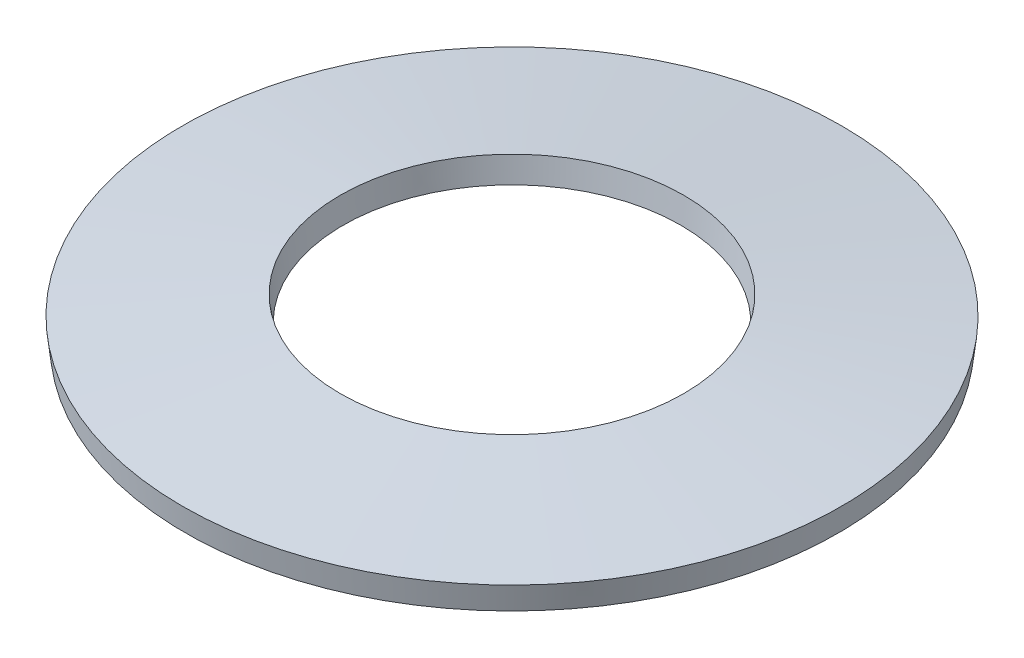
ISO-10303-21;
HEADER;
FILE_DESCRIPTION(('STEP AP214'),'2;1');
FILE_NAME('part.step','',(''),(''),'','','');
FILE_SCHEMA(('AUTOMOTIVE_DESIGN { 1 0 10303 214 1 1 1 1 }'));
ENDSEC;
DATA;
#1=APPLICATION_CONTEXT('core data for automotive mechanical design processes');
#2=APPLICATION_PROTOCOL_DEFINITION('international standard','automotive_design',2000,#1);
#3=PRODUCT_CONTEXT('',#1,'mechanical');
#4=PRODUCT('Part','Part','',(#3));
#5=PRODUCT_RELATED_PRODUCT_CATEGORY('part','',(#4));
#6=PRODUCT_DEFINITION_FORMATION('','',#4);
#7=PRODUCT_DEFINITION_CONTEXT('part definition',#1,'design');
#8=PRODUCT_DEFINITION('design','',#6,#7);
#9=PRODUCT_DEFINITION_SHAPE('','',#8);
#10=(LENGTH_UNIT() NAMED_UNIT(*) SI_UNIT(.MILLI.,.METRE.));
#11=(NAMED_UNIT(*) PLANE_ANGLE_UNIT() SI_UNIT($,.RADIAN.));
#12=(NAMED_UNIT(*) SI_UNIT($,.STERADIAN.) SOLID_ANGLE_UNIT());
#13=UNCERTAINTY_MEASURE_WITH_UNIT(LENGTH_MEASURE(1.E-05),#10,'distance_accuracy_value','');
#14=(GEOMETRIC_REPRESENTATION_CONTEXT(3) GLOBAL_UNCERTAINTY_ASSIGNED_CONTEXT((#13)) GLOBAL_UNIT_ASSIGNED_CONTEXT((#10,
#11,#12)) REPRESENTATION_CONTEXT('',''));
#15=CARTESIAN_POINT('',(0.,0.,0.));
#16=DIRECTION('',(0.,0.,1.));
#17=DIRECTION('',(1.,0.,0.));
#18=AXIS2_PLACEMENT_3D('',#15,#16,#17);
#19=CARTESIAN_POINT('',(0.,0.,0.));
#20=DIRECTION('',(0.,1.,0.));
#21=DIRECTION('',(0.,0.,1.));
#22=AXIS2_PLACEMENT_3D('',#19,#20,#21);
#23=CONICAL_SURFACE('',#22,7.92933260086635,0.118053015470559);
#24=CARTESIAN_POINT('',(0.,0.595823899067238,0.));
#25=DIRECTION('',(0.,-1.,0.));
#26=DIRECTION('',(0.,0.,-1.));
#27=AXIS2_PLACEMENT_3D('',#24,#25,#26);
#28=CIRCLE('',#27,8.);
#29=CARTESIAN_POINT('',(0.,0.595823899067238,-8.));
#30=VERTEX_POINT('',#29);
#31=EDGE_CURVE('E45',#30,#30,#28,.T.);
#32=ORIENTED_EDGE('',*,*,#31,.T.);
#33=EDGE_LOOP('',(#32));
#34=FACE_BOUND('',#33,.T.);
#35=CARTESIAN_POINT('',(0.,0.,0.));
#36=DIRECTION('',(0.,-1.,0.));
#37=DIRECTION('',(0.,0.,-1.));
#38=AXIS2_PLACEMENT_3D('',#35,#36,#37);
#39=CIRCLE('',#38,7.92933260086635);
#40=CARTESIAN_POINT('',(0.,0.,-7.92933260086635));
#41=VERTEX_POINT('',#40);
#42=EDGE_CURVE('E10',#41,#41,#39,.T.);
#43=ORIENTED_EDGE('',*,*,#42,.F.);
#44=EDGE_LOOP('',(#43));
#45=FACE_BOUND('',#44,.T.);
#46=ADVANCED_FACE('F31',(#34,#45),#23,.T.);
#47=CARTESIAN_POINT('',(0.,0.454176100932762,0.));
#48=DIRECTION('',(0.,-1.,0.));
#49=DIRECTION('',(0.,0.,-1.));
#50=AXIS2_PLACEMENT_3D('',#47,#48,#49);
#51=CONICAL_SURFACE('',#50,4.1,1.45274331132434);
#52=ORIENTED_EDGE('',*,*,#42,.T.);
#53=EDGE_LOOP('',(#52));
#54=FACE_BOUND('',#53,.T.);
#55=CARTESIAN_POINT('',(0.,0.454176100932762,0.));
#56=DIRECTION('',(0.,-1.,0.));
#57=DIRECTION('',(0.,0.,-1.));
#58=AXIS2_PLACEMENT_3D('',#55,#56,#57);
#59=CIRCLE('',#58,4.1);
#60=CARTESIAN_POINT('',(0.,0.454176100932762,-4.1));
#61=VERTEX_POINT('',#60);
#62=EDGE_CURVE('E37',#61,#61,#59,.T.);
#63=ORIENTED_EDGE('',*,*,#62,.F.);
#64=EDGE_LOOP('',(#63));
#65=FACE_BOUND('',#64,.T.);
#66=ADVANCED_FACE('F61',(#54,#65),#51,.F.);
#67=CARTESIAN_POINT('',(0.,1.05,0.));
#68=DIRECTION('',(0.,1.,0.));
#69=DIRECTION('',(0.,0.,1.));
#70=AXIS2_PLACEMENT_3D('',#67,#68,#69);
#71=CONICAL_SURFACE('',#70,4.17066739913365,0.118053015470559);
#72=ORIENTED_EDGE('',*,*,#62,.T.);
#73=EDGE_LOOP('',(#72));
#74=FACE_BOUND('',#73,.T.);
#75=CARTESIAN_POINT('',(0.,1.05,0.));
#76=DIRECTION('',(0.,-1.,0.));
#77=DIRECTION('',(0.,0.,-1.));
#78=AXIS2_PLACEMENT_3D('',#75,#76,#77);
#79=CIRCLE('',#78,4.17066739913365);
#80=CARTESIAN_POINT('',(0.,1.05,-4.17066739913365));
#81=VERTEX_POINT('',#80);
#82=EDGE_CURVE('E41',#81,#81,#79,.T.);
#83=ORIENTED_EDGE('',*,*,#82,.F.);
#84=EDGE_LOOP('',(#83));
#85=FACE_BOUND('',#84,.T.);
#86=ADVANCED_FACE('F55',(#74,#85),#71,.F.);
#87=CARTESIAN_POINT('',(0.,0.595823899067238,0.));
#88=DIRECTION('',(0.,-1.,0.));
#89=DIRECTION('',(0.,0.,-1.));
#90=AXIS2_PLACEMENT_3D('',#87,#88,#89);
#91=CONICAL_SURFACE('',#90,8.,1.45274331132434);
#92=ORIENTED_EDGE('',*,*,#82,.T.);
#93=EDGE_LOOP('',(#92));
#94=FACE_BOUND('',#93,.T.);
#95=ORIENTED_EDGE('',*,*,#31,.F.);
#96=EDGE_LOOP('',(#95));
#97=FACE_BOUND('',#96,.T.);
#98=ADVANCED_FACE('F53',(#94,#97),#91,.T.);
#99=CLOSED_SHELL('',(#46,#66,#86,#98));
#100=MANIFOLD_SOLID_BREP('B2',#99);
#101=ADVANCED_BREP_SHAPE_REPRESENTATION('',(#18,#100),#14);
#102=SHAPE_DEFINITION_REPRESENTATION(#9,#101);
ENDSEC;
END-ISO-10303-21;
